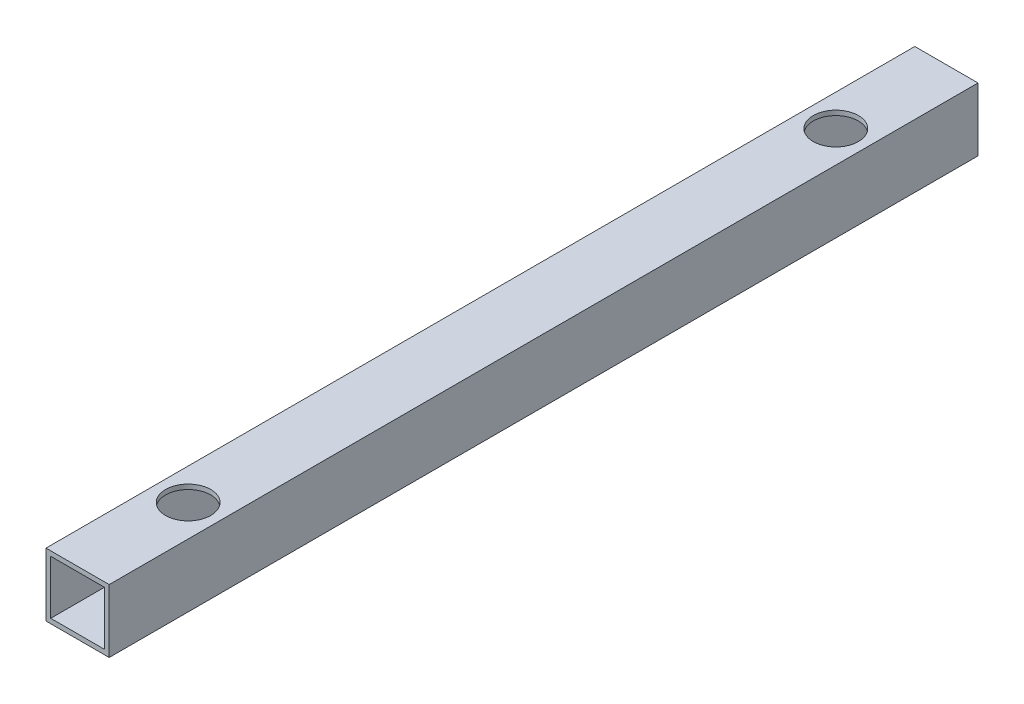
ISO-10303-21;
HEADER;
FILE_DESCRIPTION(('STEP AP214'),'2;1');
FILE_NAME('part.step','',(''),(''),'','','');
FILE_SCHEMA(('AUTOMOTIVE_DESIGN { 1 0 10303 214 1 1 1 1 }'));
ENDSEC;
DATA;
#1=APPLICATION_CONTEXT('core data for automotive mechanical design processes');
#2=APPLICATION_PROTOCOL_DEFINITION('international standard','automotive_design',2000,#1);
#3=PRODUCT_CONTEXT('',#1,'mechanical');
#4=PRODUCT('Part','Part','',(#3));
#5=PRODUCT_RELATED_PRODUCT_CATEGORY('part','',(#4));
#6=PRODUCT_DEFINITION_FORMATION('','',#4);
#7=PRODUCT_DEFINITION_CONTEXT('part definition',#1,'design');
#8=PRODUCT_DEFINITION('design','',#6,#7);
#9=PRODUCT_DEFINITION_SHAPE('','',#8);
#10=(LENGTH_UNIT() NAMED_UNIT(*) SI_UNIT(.MILLI.,.METRE.));
#11=(NAMED_UNIT(*) PLANE_ANGLE_UNIT() SI_UNIT($,.RADIAN.));
#12=(NAMED_UNIT(*) SI_UNIT($,.STERADIAN.) SOLID_ANGLE_UNIT());
#13=UNCERTAINTY_MEASURE_WITH_UNIT(LENGTH_MEASURE(1.E-05),#10,'distance_accuracy_value','');
#14=(GEOMETRIC_REPRESENTATION_CONTEXT(3) GLOBAL_UNCERTAINTY_ASSIGNED_CONTEXT((#13)) GLOBAL_UNIT_ASSIGNED_CONTEXT((#10,
#11,#12)) REPRESENTATION_CONTEXT('',''));
#15=CARTESIAN_POINT('',(0.,0.,0.));
#16=DIRECTION('',(0.,0.,1.));
#17=DIRECTION('',(1.,0.,0.));
#18=AXIS2_PLACEMENT_3D('',#15,#16,#17);
#19=CARTESIAN_POINT('',(0.,0.,550.));
#20=DIRECTION('',(0.,0.,1.));
#21=DIRECTION('',(1.,0.,0.));
#22=AXIS2_PLACEMENT_3D('',#19,#20,#21);
#23=PLANE('',#22);
#24=DIRECTION('',(0.,-1.,0.));
#25=VECTOR('',#24,1.);
#26=CARTESIAN_POINT('',(-20.,-20.,550.));
#27=LINE('',#26,#25);
#28=CARTESIAN_POINT('',(-20.,20.,550.));
#29=VERTEX_POINT('',#28);
#30=CARTESIAN_POINT('',(-20.,-20.,550.));
#31=VERTEX_POINT('',#30);
#32=EDGE_CURVE('E138',#29,#31,#27,.T.);
#33=ORIENTED_EDGE('',*,*,#32,.T.);
#34=DIRECTION('',(1.,0.,0.));
#35=VECTOR('',#34,1.);
#36=CARTESIAN_POINT('',(20.,-20.,550.));
#37=LINE('',#36,#35);
#38=CARTESIAN_POINT('',(20.,-20.,550.));
#39=VERTEX_POINT('',#38);
#40=EDGE_CURVE('E141',#31,#39,#37,.T.);
#41=ORIENTED_EDGE('',*,*,#40,.T.);
#42=DIRECTION('',(0.,1.,0.));
#43=VECTOR('',#42,1.);
#44=CARTESIAN_POINT('',(20.,-20.,550.));
#45=LINE('',#44,#43);
#46=CARTESIAN_POINT('',(20.,20.,550.));
#47=VERTEX_POINT('',#46);
#48=EDGE_CURVE('E144',#39,#47,#45,.T.);
#49=ORIENTED_EDGE('',*,*,#48,.T.);
#50=DIRECTION('',(-1.,0.,0.));
#51=VECTOR('',#50,1.);
#52=CARTESIAN_POINT('',(20.,20.,550.));
#53=LINE('',#52,#51);
#54=EDGE_CURVE('E146',#47,#29,#53,.T.);
#55=ORIENTED_EDGE('',*,*,#54,.T.);
#56=EDGE_LOOP('',(#33,#41,#49,#55));
#57=FACE_BOUND('',#56,.T.);
#58=DIRECTION('',(-1.,0.,0.));
#59=VECTOR('',#58,1.);
#60=CARTESIAN_POINT('',(17.,17.,550.));
#61=LINE('',#60,#59);
#62=CARTESIAN_POINT('',(17.,17.,550.));
#63=VERTEX_POINT('',#62);
#64=CARTESIAN_POINT('',(-17.,17.,550.));
#65=VERTEX_POINT('',#64);
#66=EDGE_CURVE('E108',#63,#65,#61,.T.);
#67=ORIENTED_EDGE('',*,*,#66,.F.);
#68=DIRECTION('',(0.,1.,0.));
#69=VECTOR('',#68,1.);
#70=CARTESIAN_POINT('',(17.,-17.,550.));
#71=LINE('',#70,#69);
#72=CARTESIAN_POINT('',(17.,-17.,550.));
#73=VERTEX_POINT('',#72);
#74=EDGE_CURVE('E100',#73,#63,#71,.T.);
#75=ORIENTED_EDGE('',*,*,#74,.F.);
#76=DIRECTION('',(1.,0.,0.));
#77=VECTOR('',#76,1.);
#78=CARTESIAN_POINT('',(17.,-17.,550.));
#79=LINE('',#78,#77);
#80=CARTESIAN_POINT('',(-17.,-17.,550.));
#81=VERTEX_POINT('',#80);
#82=EDGE_CURVE('E122',#81,#73,#79,.T.);
#83=ORIENTED_EDGE('',*,*,#82,.F.);
#84=DIRECTION('',(0.,-1.,0.));
#85=VECTOR('',#84,1.);
#86=CARTESIAN_POINT('',(-17.,-17.,550.));
#87=LINE('',#86,#85);
#88=EDGE_CURVE('E120',#65,#81,#87,.T.);
#89=ORIENTED_EDGE('',*,*,#88,.F.);
#90=EDGE_LOOP('',(#67,#75,#83,#89));
#91=FACE_BOUND('',#90,.T.);
#92=ADVANCED_FACE('F33',(#57,#91),#23,.T.);
#93=CARTESIAN_POINT('',(0.,0.,0.));
#94=DIRECTION('',(0.,0.,1.));
#95=DIRECTION('',(1.,0.,0.));
#96=AXIS2_PLACEMENT_3D('',#93,#94,#95);
#97=PLANE('',#96);
#98=DIRECTION('',(0.,-1.,0.));
#99=VECTOR('',#98,1.);
#100=CARTESIAN_POINT('',(-20.,-20.,0.));
#101=LINE('',#100,#99);
#102=CARTESIAN_POINT('',(-20.,20.,0.));
#103=VERTEX_POINT('',#102);
#104=CARTESIAN_POINT('',(-20.,-20.,0.));
#105=VERTEX_POINT('',#104);
#106=EDGE_CURVE('E116',#103,#105,#101,.T.);
#107=ORIENTED_EDGE('',*,*,#106,.F.);
#108=DIRECTION('',(-1.,0.,0.));
#109=VECTOR('',#108,1.);
#110=CARTESIAN_POINT('',(20.,20.,0.));
#111=LINE('',#110,#109);
#112=CARTESIAN_POINT('',(20.,20.,0.));
#113=VERTEX_POINT('',#112);
#114=EDGE_CURVE('E142',#113,#103,#111,.T.);
#115=ORIENTED_EDGE('',*,*,#114,.F.);
#116=DIRECTION('',(0.,1.,0.));
#117=VECTOR('',#116,1.);
#118=CARTESIAN_POINT('',(20.,-20.,0.));
#119=LINE('',#118,#117);
#120=CARTESIAN_POINT('',(20.,-20.,0.));
#121=VERTEX_POINT('',#120);
#122=EDGE_CURVE('E153',#121,#113,#119,.T.);
#123=ORIENTED_EDGE('',*,*,#122,.F.);
#124=DIRECTION('',(1.,0.,0.));
#125=VECTOR('',#124,1.);
#126=CARTESIAN_POINT('',(20.,-20.,0.));
#127=LINE('',#126,#125);
#128=EDGE_CURVE('E151',#105,#121,#127,.T.);
#129=ORIENTED_EDGE('',*,*,#128,.F.);
#130=EDGE_LOOP('',(#107,#115,#123,#129));
#131=FACE_BOUND('',#130,.T.);
#132=DIRECTION('',(0.,1.,0.));
#133=VECTOR('',#132,1.);
#134=CARTESIAN_POINT('',(17.,-17.,0.));
#135=LINE('',#134,#133);
#136=CARTESIAN_POINT('',(17.,-17.,0.));
#137=VERTEX_POINT('',#136);
#138=CARTESIAN_POINT('',(17.,17.,0.));
#139=VERTEX_POINT('',#138);
#140=EDGE_CURVE('E58',#137,#139,#135,.T.);
#141=ORIENTED_EDGE('',*,*,#140,.T.);
#142=DIRECTION('',(-1.,0.,0.));
#143=VECTOR('',#142,1.);
#144=CARTESIAN_POINT('',(17.,17.,0.));
#145=LINE('',#144,#143);
#146=CARTESIAN_POINT('',(-17.,17.,0.));
#147=VERTEX_POINT('',#146);
#148=EDGE_CURVE('E115',#139,#147,#145,.T.);
#149=ORIENTED_EDGE('',*,*,#148,.T.);
#150=DIRECTION('',(0.,-1.,0.));
#151=VECTOR('',#150,1.);
#152=CARTESIAN_POINT('',(-17.,-17.,0.));
#153=LINE('',#152,#151);
#154=CARTESIAN_POINT('',(-17.,-17.,0.));
#155=VERTEX_POINT('',#154);
#156=EDGE_CURVE('E130',#147,#155,#153,.T.);
#157=ORIENTED_EDGE('',*,*,#156,.T.);
#158=DIRECTION('',(1.,0.,0.));
#159=VECTOR('',#158,1.);
#160=CARTESIAN_POINT('',(17.,-17.,0.));
#161=LINE('',#160,#159);
#162=EDGE_CURVE('E109',#155,#137,#161,.T.);
#163=ORIENTED_EDGE('',*,*,#162,.T.);
#164=EDGE_LOOP('',(#141,#149,#157,#163));
#165=FACE_BOUND('',#164,.T.);
#166=ADVANCED_FACE('F207',(#131,#165),#97,.F.);
#167=CARTESIAN_POINT('',(-20.,-20.,550.));
#168=DIRECTION('',(1.,0.,0.));
#169=DIRECTION('',(0.,0.,-1.));
#170=AXIS2_PLACEMENT_3D('',#167,#168,#169);
#171=PLANE('',#170);
#172=ORIENTED_EDGE('',*,*,#106,.T.);
#173=DIRECTION('',(0.,0.,-1.));
#174=VECTOR('',#173,1.);
#175=CARTESIAN_POINT('',(-20.,-20.,550.));
#176=LINE('',#175,#174);
#177=EDGE_CURVE('E11',#31,#105,#176,.T.);
#178=ORIENTED_EDGE('',*,*,#177,.F.);
#179=ORIENTED_EDGE('',*,*,#32,.F.);
#180=DIRECTION('',(0.,0.,-1.));
#181=VECTOR('',#180,1.);
#182=CARTESIAN_POINT('',(-20.,20.,550.));
#183=LINE('',#182,#181);
#184=EDGE_CURVE('E148',#29,#103,#183,.T.);
#185=ORIENTED_EDGE('',*,*,#184,.T.);
#186=EDGE_LOOP('',(#172,#178,#179,#185));
#187=FACE_BOUND('',#186,.T.);
#188=ADVANCED_FACE('F35',(#187),#171,.F.);
#189=CARTESIAN_POINT('',(20.,-20.,550.));
#190=DIRECTION('',(0.,1.,0.));
#191=DIRECTION('',(-1.,0.,0.));
#192=AXIS2_PLACEMENT_3D('',#189,#190,#191);
#193=PLANE('',#192);
#194=CARTESIAN_POINT('',(0.,-19.9999999999996,480.));
#195=DIRECTION('',(0.,1.,0.));
#196=DIRECTION('',(-1.,0.,0.));
#197=AXIS2_PLACEMENT_3D('',#194,#195,#196);
#198=CIRCLE('',#197,14.3);
#199=CARTESIAN_POINT('',(-14.3,-19.9999999999996,480.));
#200=VERTEX_POINT('',#199);
#201=EDGE_CURVE('E128',#200,#200,#198,.T.);
#202=ORIENTED_EDGE('',*,*,#201,.T.);
#203=EDGE_LOOP('',(#202));
#204=FACE_BOUND('',#203,.T.);
#205=CARTESIAN_POINT('',(0.,-19.9999999999996,70.));
#206=DIRECTION('',(0.,1.,0.));
#207=DIRECTION('',(-1.,0.,0.));
#208=AXIS2_PLACEMENT_3D('',#205,#206,#207);
#209=CIRCLE('',#208,14.3);
#210=CARTESIAN_POINT('',(-14.3,-19.9999999999996,70.));
#211=VERTEX_POINT('',#210);
#212=EDGE_CURVE('E169',#211,#211,#209,.T.);
#213=ORIENTED_EDGE('',*,*,#212,.T.);
#214=EDGE_LOOP('',(#213));
#215=FACE_BOUND('',#214,.T.);
#216=ORIENTED_EDGE('',*,*,#128,.T.);
#217=DIRECTION('',(0.,0.,-1.));
#218=VECTOR('',#217,1.);
#219=CARTESIAN_POINT('',(20.,-20.,550.));
#220=LINE('',#219,#218);
#221=EDGE_CURVE('E42',#39,#121,#220,.T.);
#222=ORIENTED_EDGE('',*,*,#221,.F.);
#223=ORIENTED_EDGE('',*,*,#40,.F.);
#224=ORIENTED_EDGE('',*,*,#177,.T.);
#225=EDGE_LOOP('',(#216,#222,#223,#224));
#226=FACE_BOUND('',#225,.T.);
#227=ADVANCED_FACE('F186',(#204,#215,#226),#193,.F.);
#228=CARTESIAN_POINT('',(20.,-20.,550.));
#229=DIRECTION('',(-1.,0.,0.));
#230=DIRECTION('',(0.,0.,1.));
#231=AXIS2_PLACEMENT_3D('',#228,#229,#230);
#232=PLANE('',#231);
#233=ORIENTED_EDGE('',*,*,#122,.T.);
#234=DIRECTION('',(0.,0.,-1.));
#235=VECTOR('',#234,1.);
#236=CARTESIAN_POINT('',(20.,20.,550.));
#237=LINE('',#236,#235);
#238=EDGE_CURVE('E158',#47,#113,#237,.T.);
#239=ORIENTED_EDGE('',*,*,#238,.F.);
#240=ORIENTED_EDGE('',*,*,#48,.F.);
#241=ORIENTED_EDGE('',*,*,#221,.T.);
#242=EDGE_LOOP('',(#233,#239,#240,#241));
#243=FACE_BOUND('',#242,.T.);
#244=ADVANCED_FACE('F221',(#243),#232,.F.);
#245=CARTESIAN_POINT('',(20.,20.,550.));
#246=DIRECTION('',(0.,-1.,0.));
#247=DIRECTION('',(1.,0.,0.));
#248=AXIS2_PLACEMENT_3D('',#245,#246,#247);
#249=PLANE('',#248);
#250=CARTESIAN_POINT('',(0.,20.,480.));
#251=DIRECTION('',(0.,1.,0.));
#252=DIRECTION('',(-1.,0.,0.));
#253=AXIS2_PLACEMENT_3D('',#250,#251,#252);
#254=CIRCLE('',#253,14.3);
#255=CARTESIAN_POINT('',(-14.3,20.,480.));
#256=VERTEX_POINT('',#255);
#257=EDGE_CURVE('E165',#256,#256,#254,.T.);
#258=ORIENTED_EDGE('',*,*,#257,.F.);
#259=EDGE_LOOP('',(#258));
#260=FACE_BOUND('',#259,.T.);
#261=CARTESIAN_POINT('',(0.,20.,70.));
#262=DIRECTION('',(0.,1.,0.));
#263=DIRECTION('',(1.,0.,0.));
#264=AXIS2_PLACEMENT_3D('',#261,#262,#263);
#265=CIRCLE('',#264,14.3);
#266=CARTESIAN_POINT('',(14.3,20.,70.));
#267=VERTEX_POINT('',#266);
#268=EDGE_CURVE('E172',#267,#267,#265,.T.);
#269=ORIENTED_EDGE('',*,*,#268,.F.);
#270=EDGE_LOOP('',(#269));
#271=FACE_BOUND('',#270,.T.);
#272=ORIENTED_EDGE('',*,*,#114,.T.);
#273=ORIENTED_EDGE('',*,*,#184,.F.);
#274=ORIENTED_EDGE('',*,*,#54,.F.);
#275=ORIENTED_EDGE('',*,*,#238,.T.);
#276=EDGE_LOOP('',(#272,#273,#274,#275));
#277=FACE_BOUND('',#276,.T.);
#278=ADVANCED_FACE('F218',(#260,#271,#277),#249,.F.);
#279=CARTESIAN_POINT('',(17.,-17.,550.));
#280=DIRECTION('',(-1.,0.,0.));
#281=DIRECTION('',(0.,0.,1.));
#282=AXIS2_PLACEMENT_3D('',#279,#280,#281);
#283=PLANE('',#282);
#284=ORIENTED_EDGE('',*,*,#140,.F.);
#285=DIRECTION('',(0.,0.,-1.));
#286=VECTOR('',#285,1.);
#287=CARTESIAN_POINT('',(17.,-17.,550.));
#288=LINE('',#287,#286);
#289=EDGE_CURVE('E104',#73,#137,#288,.T.);
#290=ORIENTED_EDGE('',*,*,#289,.F.);
#291=ORIENTED_EDGE('',*,*,#74,.T.);
#292=DIRECTION('',(0.,0.,-1.));
#293=VECTOR('',#292,1.);
#294=CARTESIAN_POINT('',(17.,17.,550.));
#295=LINE('',#294,#293);
#296=EDGE_CURVE('E103',#63,#139,#295,.T.);
#297=ORIENTED_EDGE('',*,*,#296,.T.);
#298=EDGE_LOOP('',(#284,#290,#291,#297));
#299=FACE_BOUND('',#298,.T.);
#300=ADVANCED_FACE('F102',(#299),#283,.T.);
#301=CARTESIAN_POINT('',(17.,17.,550.));
#302=DIRECTION('',(0.,-1.,0.));
#303=DIRECTION('',(1.,0.,0.));
#304=AXIS2_PLACEMENT_3D('',#301,#302,#303);
#305=PLANE('',#304);
#306=CARTESIAN_POINT('',(0.,16.9999999999995,480.));
#307=DIRECTION('',(0.,-1.,0.));
#308=DIRECTION('',(1.,0.,0.));
#309=AXIS2_PLACEMENT_3D('',#306,#307,#308);
#310=CIRCLE('',#309,14.3);
#311=CARTESIAN_POINT('',(14.3,16.9999999999995,480.));
#312=VERTEX_POINT('',#311);
#313=EDGE_CURVE('E181',#312,#312,#310,.T.);
#314=ORIENTED_EDGE('',*,*,#313,.F.);
#315=EDGE_LOOP('',(#314));
#316=FACE_BOUND('',#315,.T.);
#317=CARTESIAN_POINT('',(0.,16.9999999999995,70.));
#318=DIRECTION('',(0.,-1.,0.));
#319=DIRECTION('',(1.,0.,0.));
#320=AXIS2_PLACEMENT_3D('',#317,#318,#319);
#321=CIRCLE('',#320,14.3);
#322=CARTESIAN_POINT('',(14.3,16.9999999999995,70.));
#323=VERTEX_POINT('',#322);
#324=EDGE_CURVE('E164',#323,#323,#321,.T.);
#325=ORIENTED_EDGE('',*,*,#324,.F.);
#326=EDGE_LOOP('',(#325));
#327=FACE_BOUND('',#326,.T.);
#328=ORIENTED_EDGE('',*,*,#148,.F.);
#329=ORIENTED_EDGE('',*,*,#296,.F.);
#330=ORIENTED_EDGE('',*,*,#66,.T.);
#331=DIRECTION('',(0.,0.,-1.));
#332=VECTOR('',#331,1.);
#333=CARTESIAN_POINT('',(-17.,17.,550.));
#334=LINE('',#333,#332);
#335=EDGE_CURVE('E117',#65,#147,#334,.T.);
#336=ORIENTED_EDGE('',*,*,#335,.T.);
#337=EDGE_LOOP('',(#328,#329,#330,#336));
#338=FACE_BOUND('',#337,.T.);
#339=ADVANCED_FACE('F112',(#316,#327,#338),#305,.T.);
#340=CARTESIAN_POINT('',(-17.,-17.,550.));
#341=DIRECTION('',(1.,0.,0.));
#342=DIRECTION('',(0.,1.,0.));
#343=AXIS2_PLACEMENT_3D('',#340,#341,#342);
#344=PLANE('',#343);
#345=ORIENTED_EDGE('',*,*,#156,.F.);
#346=ORIENTED_EDGE('',*,*,#335,.F.);
#347=ORIENTED_EDGE('',*,*,#88,.T.);
#348=DIRECTION('',(0.,0.,-1.));
#349=VECTOR('',#348,1.);
#350=CARTESIAN_POINT('',(-17.,-17.,550.));
#351=LINE('',#350,#349);
#352=EDGE_CURVE('E50',#81,#155,#351,.T.);
#353=ORIENTED_EDGE('',*,*,#352,.T.);
#354=EDGE_LOOP('',(#345,#346,#347,#353));
#355=FACE_BOUND('',#354,.T.);
#356=ADVANCED_FACE('F247',(#355),#344,.T.);
#357=CARTESIAN_POINT('',(17.,-17.,550.));
#358=DIRECTION('',(0.,1.,0.));
#359=DIRECTION('',(0.,0.,1.));
#360=AXIS2_PLACEMENT_3D('',#357,#358,#359);
#361=PLANE('',#360);
#362=CARTESIAN_POINT('',(0.,-16.9999999999995,480.));
#363=DIRECTION('',(0.,1.,0.));
#364=DIRECTION('',(0.,0.,1.));
#365=AXIS2_PLACEMENT_3D('',#362,#363,#364);
#366=CIRCLE('',#365,14.3);
#367=CARTESIAN_POINT('',(0.,-16.9999999999995,494.3));
#368=VERTEX_POINT('',#367);
#369=EDGE_CURVE('E37',#368,#368,#366,.T.);
#370=ORIENTED_EDGE('',*,*,#369,.F.);
#371=EDGE_LOOP('',(#370));
#372=FACE_BOUND('',#371,.T.);
#373=CARTESIAN_POINT('',(0.,-16.9999999999995,70.));
#374=DIRECTION('',(0.,1.,0.));
#375=DIRECTION('',(0.,0.,1.));
#376=AXIS2_PLACEMENT_3D('',#373,#374,#375);
#377=CIRCLE('',#376,14.3);
#378=CARTESIAN_POINT('',(0.,-16.9999999999995,84.3));
#379=VERTEX_POINT('',#378);
#380=EDGE_CURVE('E162',#379,#379,#377,.T.);
#381=ORIENTED_EDGE('',*,*,#380,.F.);
#382=EDGE_LOOP('',(#381));
#383=FACE_BOUND('',#382,.T.);
#384=ORIENTED_EDGE('',*,*,#162,.F.);
#385=ORIENTED_EDGE('',*,*,#352,.F.);
#386=ORIENTED_EDGE('',*,*,#82,.T.);
#387=ORIENTED_EDGE('',*,*,#289,.T.);
#388=EDGE_LOOP('',(#384,#385,#386,#387));
#389=FACE_BOUND('',#388,.T.);
#390=ADVANCED_FACE('F202',(#372,#383,#389),#361,.T.);
#391=CARTESIAN_POINT('',(1.73125402902485E-12,-9980.,70.));
#392=DIRECTION('',(0.,1.,0.));
#393=DIRECTION('',(-1.,0.,0.));
#394=AXIS2_PLACEMENT_3D('',#391,#392,#393);
#395=CYLINDRICAL_SURFACE('',#394,14.3);
#396=ORIENTED_EDGE('',*,*,#380,.T.);
#397=EDGE_LOOP('',(#396));
#398=FACE_BOUND('',#397,.T.);
#399=ORIENTED_EDGE('',*,*,#212,.F.);
#400=EDGE_LOOP('',(#399));
#401=FACE_BOUND('',#400,.T.);
#402=ADVANCED_FACE('F192',(#398,#401),#395,.F.);
#403=CARTESIAN_POINT('',(1.73125402902485E-12,-9980.,480.));
#404=DIRECTION('',(0.,1.,0.));
#405=DIRECTION('',(-1.,0.,0.));
#406=AXIS2_PLACEMENT_3D('',#403,#404,#405);
#407=CYLINDRICAL_SURFACE('',#406,14.3);
#408=ORIENTED_EDGE('',*,*,#369,.T.);
#409=EDGE_LOOP('',(#408));
#410=FACE_BOUND('',#409,.T.);
#411=ORIENTED_EDGE('',*,*,#201,.F.);
#412=EDGE_LOOP('',(#411));
#413=FACE_BOUND('',#412,.T.);
#414=ADVANCED_FACE('F189',(#410,#413),#407,.F.);
#415=ORIENTED_EDGE('',*,*,#324,.T.);
#416=EDGE_LOOP('',(#415));
#417=FACE_BOUND('',#416,.T.);
#418=ORIENTED_EDGE('',*,*,#268,.T.);
#419=EDGE_LOOP('',(#418));
#420=FACE_BOUND('',#419,.T.);
#421=ADVANCED_FACE('F191',(#417,#420),#395,.F.);
#422=ORIENTED_EDGE('',*,*,#313,.T.);
#423=EDGE_LOOP('',(#422));
#424=FACE_BOUND('',#423,.T.);
#425=ORIENTED_EDGE('',*,*,#257,.T.);
#426=EDGE_LOOP('',(#425));
#427=FACE_BOUND('',#426,.T.);
#428=ADVANCED_FACE('F195',(#424,#427),#407,.F.);
#429=CLOSED_SHELL('',(#92,#166,#188,#227,#244,#278,#300,#339,#356,#390,#402,#414,#421,#428));
#430=MANIFOLD_SOLID_BREP('B2',#429);
#431=ADVANCED_BREP_SHAPE_REPRESENTATION('',(#18,#430),#14);
#432=SHAPE_DEFINITION_REPRESENTATION(#9,#431);
ENDSEC;
END-ISO-10303-21;
